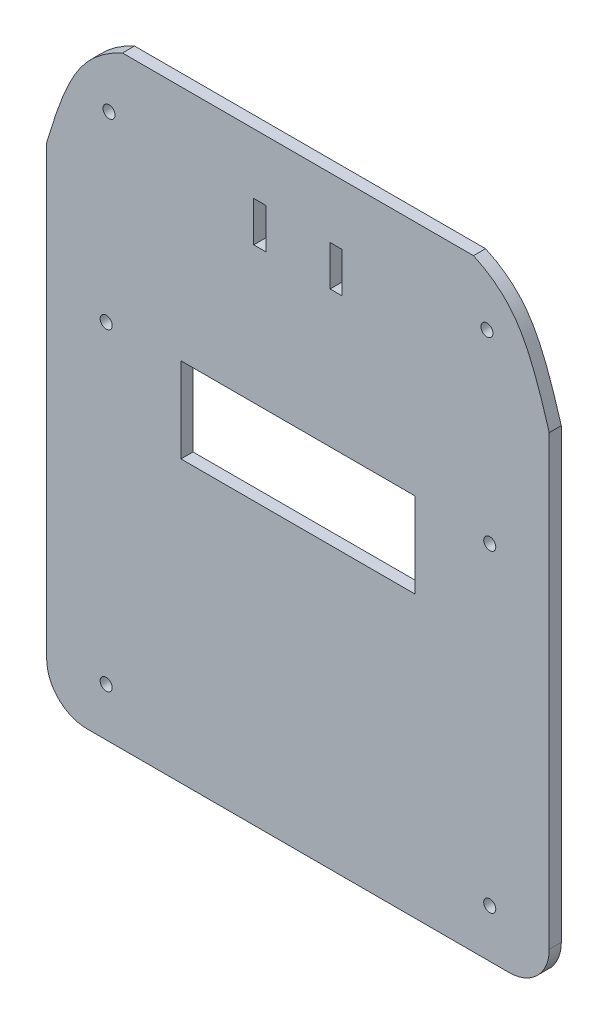
ISO-10303-21;
HEADER;
FILE_DESCRIPTION(('STEP AP214'),'2;1');
FILE_NAME('part.step','',(''),(''),'','','');
FILE_SCHEMA(('AUTOMOTIVE_DESIGN { 1 0 10303 214 1 1 1 1 }'));
ENDSEC;
DATA;
#1=APPLICATION_CONTEXT('core data for automotive mechanical design processes');
#2=APPLICATION_PROTOCOL_DEFINITION('international standard','automotive_design',2000,#1);
#3=PRODUCT_CONTEXT('',#1,'mechanical');
#4=PRODUCT('Part','Part','',(#3));
#5=PRODUCT_RELATED_PRODUCT_CATEGORY('part','',(#4));
#6=PRODUCT_DEFINITION_FORMATION('','',#4);
#7=PRODUCT_DEFINITION_CONTEXT('part definition',#1,'design');
#8=PRODUCT_DEFINITION('design','',#6,#7);
#9=PRODUCT_DEFINITION_SHAPE('','',#8);
#10=(LENGTH_UNIT() NAMED_UNIT(*) SI_UNIT(.MILLI.,.METRE.));
#11=(NAMED_UNIT(*) PLANE_ANGLE_UNIT() SI_UNIT($,.RADIAN.));
#12=(NAMED_UNIT(*) SI_UNIT($,.STERADIAN.) SOLID_ANGLE_UNIT());
#13=UNCERTAINTY_MEASURE_WITH_UNIT(LENGTH_MEASURE(1.E-05),#10,'distance_accuracy_value','');
#14=(GEOMETRIC_REPRESENTATION_CONTEXT(3) GLOBAL_UNCERTAINTY_ASSIGNED_CONTEXT((#13)) GLOBAL_UNIT_ASSIGNED_CONTEXT((#10,
#11,#12)) REPRESENTATION_CONTEXT('',''));
#15=CARTESIAN_POINT('',(0.,0.,0.));
#16=DIRECTION('',(0.,0.,1.));
#17=DIRECTION('',(1.,0.,0.));
#18=AXIS2_PLACEMENT_3D('',#15,#16,#17);
#19=CARTESIAN_POINT('',(0.,0.,3.));
#20=DIRECTION('',(1.,0.,0.));
#21=DIRECTION('',(0.,0.,-1.));
#22=AXIS2_PLACEMENT_3D('',#19,#20,#21);
#23=PLANE('',#22);
#24=DIRECTION('',(0.,-1.,0.));
#25=VECTOR('',#24,1.);
#26=CARTESIAN_POINT('',(0.,0.,0.));
#27=LINE('',#26,#25);
#28=CARTESIAN_POINT('',(0.,121.303805560754,0.));
#29=VERTEX_POINT('',#28);
#30=CARTESIAN_POINT('',(0.,10.,0.));
#31=VERTEX_POINT('',#30);
#32=EDGE_CURVE('E405',#29,#31,#27,.T.);
#33=ORIENTED_EDGE('',*,*,#32,.T.);
#34=DIRECTION('',(0.,0.,-1.));
#35=VECTOR('',#34,1.);
#36=CARTESIAN_POINT('',(0.,10.,3.));
#37=LINE('',#36,#35);
#38=CARTESIAN_POINT('',(0.,10.,3.));
#39=VERTEX_POINT('',#38);
#40=EDGE_CURVE('E11',#31,#39,#37,.F.);
#41=ORIENTED_EDGE('',*,*,#40,.T.);
#42=DIRECTION('',(0.,-1.,0.));
#43=VECTOR('',#42,1.);
#44=CARTESIAN_POINT('',(0.,0.,3.));
#45=LINE('',#44,#43);
#46=CARTESIAN_POINT('',(0.,121.303805560754,3.));
#47=VERTEX_POINT('',#46);
#48=EDGE_CURVE('E419',#47,#39,#45,.T.);
#49=ORIENTED_EDGE('',*,*,#48,.F.);
#50=DIRECTION('',(0.,0.,1.));
#51=VECTOR('',#50,1.);
#52=CARTESIAN_POINT('',(0.,121.303805560754,0.));
#53=LINE('',#52,#51);
#54=EDGE_CURVE('E418',#29,#47,#53,.T.);
#55=ORIENTED_EDGE('',*,*,#54,.F.);
#56=EDGE_LOOP('',(#33,#41,#49,#55));
#57=FACE_BOUND('',#56,.T.);
#58=ADVANCED_FACE('F38',(#57),#23,.F.);
#59=CARTESIAN_POINT('',(0.,0.,3.));
#60=DIRECTION('',(0.,1.,0.));
#61=DIRECTION('',(0.,0.,1.));
#62=AXIS2_PLACEMENT_3D('',#59,#60,#61);
#63=PLANE('',#62);
#64=DIRECTION('',(1.,0.,0.));
#65=VECTOR('',#64,1.);
#66=CARTESIAN_POINT('',(0.,0.,0.));
#67=LINE('',#66,#65);
#68=CARTESIAN_POINT('',(10.,0.,0.));
#69=VERTEX_POINT('',#68);
#70=CARTESIAN_POINT('',(115.,0.,0.));
#71=VERTEX_POINT('',#70);
#72=EDGE_CURVE('E439',#69,#71,#67,.T.);
#73=ORIENTED_EDGE('',*,*,#72,.T.);
#74=DIRECTION('',(0.,0.,-1.));
#75=VECTOR('',#74,1.);
#76=CARTESIAN_POINT('',(115.,0.,3.));
#77=LINE('',#76,#75);
#78=CARTESIAN_POINT('',(115.,0.,3.));
#79=VERTEX_POINT('',#78);
#80=EDGE_CURVE('E462',#71,#79,#77,.F.);
#81=ORIENTED_EDGE('',*,*,#80,.T.);
#82=DIRECTION('',(1.,0.,0.));
#83=VECTOR('',#82,1.);
#84=CARTESIAN_POINT('',(0.,0.,3.));
#85=LINE('',#84,#83);
#86=CARTESIAN_POINT('',(10.,0.,3.));
#87=VERTEX_POINT('',#86);
#88=EDGE_CURVE('E423',#87,#79,#85,.T.);
#89=ORIENTED_EDGE('',*,*,#88,.F.);
#90=DIRECTION('',(0.,0.,-1.));
#91=VECTOR('',#90,1.);
#92=CARTESIAN_POINT('',(10.,0.,3.));
#93=LINE('',#92,#91);
#94=EDGE_CURVE('E458',#87,#69,#93,.T.);
#95=ORIENTED_EDGE('',*,*,#94,.T.);
#96=EDGE_LOOP('',(#73,#81,#89,#95));
#97=FACE_BOUND('',#96,.T.);
#98=ADVANCED_FACE('F486',(#97),#63,.F.);
#99=CARTESIAN_POINT('',(125.,0.,3.));
#100=DIRECTION('',(-1.,0.,0.));
#101=DIRECTION('',(0.,0.,1.));
#102=AXIS2_PLACEMENT_3D('',#99,#100,#101);
#103=PLANE('',#102);
#104=DIRECTION('',(0.,1.,0.));
#105=VECTOR('',#104,1.);
#106=CARTESIAN_POINT('',(125.,0.,3.));
#107=LINE('',#106,#105);
#108=CARTESIAN_POINT('',(125.,10.,3.));
#109=VERTEX_POINT('',#108);
#110=CARTESIAN_POINT('',(125.,121.303805560754,3.));
#111=VERTEX_POINT('',#110);
#112=EDGE_CURVE('E428',#109,#111,#107,.T.);
#113=ORIENTED_EDGE('',*,*,#112,.F.);
#114=DIRECTION('',(0.,0.,-1.));
#115=VECTOR('',#114,1.);
#116=CARTESIAN_POINT('',(125.,10.,3.));
#117=LINE('',#116,#115);
#118=CARTESIAN_POINT('',(125.,10.,0.));
#119=VERTEX_POINT('',#118);
#120=EDGE_CURVE('E435',#109,#119,#117,.T.);
#121=ORIENTED_EDGE('',*,*,#120,.T.);
#122=DIRECTION('',(0.,1.,0.));
#123=VECTOR('',#122,1.);
#124=CARTESIAN_POINT('',(125.,0.,0.));
#125=LINE('',#124,#123);
#126=CARTESIAN_POINT('',(125.,121.303805560754,0.));
#127=VERTEX_POINT('',#126);
#128=EDGE_CURVE('E443',#119,#127,#125,.T.);
#129=ORIENTED_EDGE('',*,*,#128,.T.);
#130=DIRECTION('',(0.,0.,1.));
#131=VECTOR('',#130,1.);
#132=CARTESIAN_POINT('',(125.,121.303805560754,0.));
#133=LINE('',#132,#131);
#134=EDGE_CURVE('E383',#127,#111,#133,.T.);
#135=ORIENTED_EDGE('',*,*,#134,.T.);
#136=EDGE_LOOP('',(#113,#121,#129,#135));
#137=FACE_BOUND('',#136,.T.);
#138=ADVANCED_FACE('F478',(#137),#103,.F.);
#139=CARTESIAN_POINT('',(0.,150.,3.));
#140=DIRECTION('',(0.,-1.,0.));
#141=DIRECTION('',(0.,0.,-1.));
#142=AXIS2_PLACEMENT_3D('',#139,#140,#141);
#143=PLANE('',#142);
#144=DIRECTION('',(-1.,0.,0.));
#145=VECTOR('',#144,1.);
#146=CARTESIAN_POINT('',(0.,150.,0.));
#147=LINE('',#146,#145);
#148=CARTESIAN_POINT('',(106.161439589976,150.,0.));
#149=VERTEX_POINT('',#148);
#150=CARTESIAN_POINT('',(18.8385604100237,150.,0.));
#151=VERTEX_POINT('',#150);
#152=EDGE_CURVE('E424',#149,#151,#147,.T.);
#153=ORIENTED_EDGE('',*,*,#152,.T.);
#154=DIRECTION('',(0.,0.,1.));
#155=VECTOR('',#154,1.);
#156=CARTESIAN_POINT('',(18.8385604100237,150.,0.));
#157=LINE('',#156,#155);
#158=CARTESIAN_POINT('',(18.8385604100237,150.,3.));
#159=VERTEX_POINT('',#158);
#160=EDGE_CURVE('E352',#151,#159,#157,.T.);
#161=ORIENTED_EDGE('',*,*,#160,.T.);
#162=DIRECTION('',(-1.,0.,0.));
#163=VECTOR('',#162,1.);
#164=CARTESIAN_POINT('',(0.,150.,3.));
#165=LINE('',#164,#163);
#166=CARTESIAN_POINT('',(106.161439589976,150.,3.));
#167=VERTEX_POINT('',#166);
#168=EDGE_CURVE('E431',#167,#159,#165,.T.);
#169=ORIENTED_EDGE('',*,*,#168,.F.);
#170=DIRECTION('',(0.,0.,1.));
#171=VECTOR('',#170,1.);
#172=CARTESIAN_POINT('',(106.161439589976,150.,0.));
#173=LINE('',#172,#171);
#174=EDGE_CURVE('E392',#149,#167,#173,.T.);
#175=ORIENTED_EDGE('',*,*,#174,.F.);
#176=EDGE_LOOP('',(#153,#161,#169,#175));
#177=FACE_BOUND('',#176,.T.);
#178=ADVANCED_FACE('F501',(#177),#143,.F.);
#179=CARTESIAN_POINT('',(0.,0.,3.));
#180=DIRECTION('',(0.,0.,-1.));
#181=DIRECTION('',(-1.,0.,0.));
#182=AXIS2_PLACEMENT_3D('',#179,#180,#181);
#183=PLANE('',#182);
#184=DIRECTION('',(1.,0.,0.));
#185=VECTOR('',#184,1.);
#186=CARTESIAN_POINT('',(51.5,125.,3.));
#187=LINE('',#186,#185);
#188=CARTESIAN_POINT('',(51.5,125.,3.));
#189=VERTEX_POINT('',#188);
#190=CARTESIAN_POINT('',(54.5,125.,3.));
#191=VERTEX_POINT('',#190);
#192=EDGE_CURVE('E212',#189,#191,#187,.T.);
#193=ORIENTED_EDGE('',*,*,#192,.F.);
#194=DIRECTION('',(0.,-1.,0.));
#195=VECTOR('',#194,1.);
#196=CARTESIAN_POINT('',(51.5,125.,3.));
#197=LINE('',#196,#195);
#198=CARTESIAN_POINT('',(51.5,135.,3.));
#199=VERTEX_POINT('',#198);
#200=EDGE_CURVE('E54',#199,#189,#197,.T.);
#201=ORIENTED_EDGE('',*,*,#200,.F.);
#202=DIRECTION('',(-1.,0.,0.));
#203=VECTOR('',#202,1.);
#204=CARTESIAN_POINT('',(51.5,135.,3.));
#205=LINE('',#204,#203);
#206=CARTESIAN_POINT('',(54.5,135.,3.));
#207=VERTEX_POINT('',#206);
#208=EDGE_CURVE('E199',#207,#199,#205,.T.);
#209=ORIENTED_EDGE('',*,*,#208,.F.);
#210=DIRECTION('',(0.,1.,0.));
#211=VECTOR('',#210,1.);
#212=CARTESIAN_POINT('',(54.5,125.,3.));
#213=LINE('',#212,#211);
#214=EDGE_CURVE('E203',#191,#207,#213,.T.);
#215=ORIENTED_EDGE('',*,*,#214,.F.);
#216=EDGE_LOOP('',(#193,#201,#209,#215));
#217=FACE_BOUND('',#216,.T.);
#218=DIRECTION('',(0.,1.,0.));
#219=VECTOR('',#218,1.);
#220=CARTESIAN_POINT('',(73.5,125.,3.));
#221=LINE('',#220,#219);
#222=CARTESIAN_POINT('',(73.5,125.,3.));
#223=VERTEX_POINT('',#222);
#224=CARTESIAN_POINT('',(73.5,135.,3.));
#225=VERTEX_POINT('',#224);
#226=EDGE_CURVE('E248',#223,#225,#221,.T.);
#227=ORIENTED_EDGE('',*,*,#226,.F.);
#228=DIRECTION('',(1.,0.,0.));
#229=VECTOR('',#228,1.);
#230=CARTESIAN_POINT('',(73.5,125.,3.));
#231=LINE('',#230,#229);
#232=CARTESIAN_POINT('',(70.5,125.,3.));
#233=VERTEX_POINT('',#232);
#234=EDGE_CURVE('E62',#233,#223,#231,.T.);
#235=ORIENTED_EDGE('',*,*,#234,.F.);
#236=DIRECTION('',(0.,-1.,0.));
#237=VECTOR('',#236,1.);
#238=CARTESIAN_POINT('',(70.5,125.,3.));
#239=LINE('',#238,#237);
#240=CARTESIAN_POINT('',(70.5,135.,3.));
#241=VERTEX_POINT('',#240);
#242=EDGE_CURVE('E233',#241,#233,#239,.T.);
#243=ORIENTED_EDGE('',*,*,#242,.F.);
#244=DIRECTION('',(-1.,0.,0.));
#245=VECTOR('',#244,1.);
#246=CARTESIAN_POINT('',(73.5,135.,3.));
#247=LINE('',#246,#245);
#248=EDGE_CURVE('E252',#225,#241,#247,.T.);
#249=ORIENTED_EDGE('',*,*,#248,.F.);
#250=EDGE_LOOP('',(#227,#235,#243,#249));
#251=FACE_BOUND('',#250,.T.);
#252=DIRECTION('',(1.,0.,0.));
#253=VECTOR('',#252,1.);
#254=CARTESIAN_POINT('',(33.4014139140333,69.834441381547,3.));
#255=LINE('',#254,#253);
#256=CARTESIAN_POINT('',(33.4014139140333,69.834441381547,3.));
#257=VERTEX_POINT('',#256);
#258=CARTESIAN_POINT('',(91.5985860859667,69.834441381547,3.));
#259=VERTEX_POINT('',#258);
#260=EDGE_CURVE('E289',#257,#259,#255,.T.);
#261=ORIENTED_EDGE('',*,*,#260,.F.);
#262=DIRECTION('',(0.,-1.,0.));
#263=VECTOR('',#262,1.);
#264=CARTESIAN_POINT('',(33.4014139140333,90.9736993548838,3.));
#265=LINE('',#264,#263);
#266=CARTESIAN_POINT('',(33.4014139140333,90.9736993548838,3.));
#267=VERTEX_POINT('',#266);
#268=EDGE_CURVE('E222',#267,#257,#265,.T.);
#269=ORIENTED_EDGE('',*,*,#268,.F.);
#270=DIRECTION('',(-1.,0.,0.));
#271=VECTOR('',#270,1.);
#272=CARTESIAN_POINT('',(33.4014139140333,90.9736993548838,3.));
#273=LINE('',#272,#271);
#274=CARTESIAN_POINT('',(91.5985860859667,90.9736993548838,3.));
#275=VERTEX_POINT('',#274);
#276=EDGE_CURVE('E274',#275,#267,#273,.T.);
#277=ORIENTED_EDGE('',*,*,#276,.F.);
#278=DIRECTION('',(0.,1.,0.));
#279=VECTOR('',#278,1.);
#280=CARTESIAN_POINT('',(91.5985860859667,90.9736993548838,3.));
#281=LINE('',#280,#279);
#282=EDGE_CURVE('E293',#259,#275,#281,.T.);
#283=ORIENTED_EDGE('',*,*,#282,.F.);
#284=EDGE_LOOP('',(#261,#269,#277,#283));
#285=FACE_BOUND('',#284,.T.);
#286=CARTESIAN_POINT('',(14.8,90.,3.));
#287=DIRECTION('',(0.,0.,1.));
#288=DIRECTION('',(1.,0.,0.));
#289=AXIS2_PLACEMENT_3D('',#286,#287,#288);
#290=CIRCLE('',#289,1.5);
#291=CARTESIAN_POINT('',(16.3,90.,3.));
#292=VERTEX_POINT('',#291);
#293=EDGE_CURVE('E326',#292,#292,#290,.T.);
#294=ORIENTED_EDGE('',*,*,#293,.F.);
#295=EDGE_LOOP('',(#294));
#296=FACE_BOUND('',#295,.T.);
#297=CARTESIAN_POINT('',(110.2,12.,3.));
#298=DIRECTION('',(0.,0.,1.));
#299=DIRECTION('',(-1.,0.,0.));
#300=AXIS2_PLACEMENT_3D('',#297,#298,#299);
#301=CIRCLE('',#300,1.50000000000001);
#302=CARTESIAN_POINT('',(108.7,12.,3.));
#303=VERTEX_POINT('',#302);
#304=EDGE_CURVE('E317',#303,#303,#301,.T.);
#305=ORIENTED_EDGE('',*,*,#304,.F.);
#306=EDGE_LOOP('',(#305));
#307=FACE_BOUND('',#306,.T.);
#308=CARTESIAN_POINT('',(110.2,90.,3.));
#309=DIRECTION('',(0.,0.,1.));
#310=DIRECTION('',(-1.,0.,0.));
#311=AXIS2_PLACEMENT_3D('',#308,#309,#310);
#312=CIRCLE('',#311,1.5);
#313=CARTESIAN_POINT('',(108.7,90.,3.));
#314=VERTEX_POINT('',#313);
#315=EDGE_CURVE('E303',#314,#314,#312,.T.);
#316=ORIENTED_EDGE('',*,*,#315,.F.);
#317=EDGE_LOOP('',(#316));
#318=FACE_BOUND('',#317,.T.);
#319=CARTESIAN_POINT('',(14.8,12.,3.));
#320=DIRECTION('',(0.,0.,1.));
#321=DIRECTION('',(1.,0.,0.));
#322=AXIS2_PLACEMENT_3D('',#319,#320,#321);
#323=CIRCLE('',#322,1.5);
#324=CARTESIAN_POINT('',(16.3,12.,3.));
#325=VERTEX_POINT('',#324);
#326=EDGE_CURVE('E325',#325,#325,#323,.T.);
#327=ORIENTED_EDGE('',*,*,#326,.F.);
#328=EDGE_LOOP('',(#327));
#329=FACE_BOUND('',#328,.T.);
#330=CARTESIAN_POINT('',(15.5,135.678181118028,3.));
#331=DIRECTION('',(0.,0.,-1.));
#332=DIRECTION('',(-1.,0.,0.));
#333=AXIS2_PLACEMENT_3D('',#330,#331,#332);
#334=CIRCLE('',#333,1.5);
#335=CARTESIAN_POINT('',(14.,135.678181118028,3.));
#336=VERTEX_POINT('',#335);
#337=EDGE_CURVE('E401',#336,#336,#334,.T.);
#338=ORIENTED_EDGE('',*,*,#337,.T.);
#339=EDGE_LOOP('',(#338));
#340=FACE_BOUND('',#339,.T.);
#341=CARTESIAN_POINT('',(109.5,135.678181118028,3.));
#342=DIRECTION('',(0.,0.,-1.));
#343=DIRECTION('',(1.,0.,0.));
#344=AXIS2_PLACEMENT_3D('',#341,#342,#343);
#345=CIRCLE('',#344,1.5);
#346=CARTESIAN_POINT('',(111.,135.678181118028,3.));
#347=VERTEX_POINT('',#346);
#348=EDGE_CURVE('E410',#347,#347,#345,.T.);
#349=ORIENTED_EDGE('',*,*,#348,.T.);
#350=EDGE_LOOP('',(#349));
#351=FACE_BOUND('',#350,.T.);
#352=ORIENTED_EDGE('',*,*,#88,.T.);
#353=CARTESIAN_POINT('',(115.,10.,3.));
#354=DIRECTION('',(0.,0.,-1.));
#355=DIRECTION('',(-1.,0.,0.));
#356=AXIS2_PLACEMENT_3D('',#353,#354,#355);
#357=CIRCLE('',#356,10.);
#358=EDGE_CURVE('E47',#79,#109,#357,.F.);
#359=ORIENTED_EDGE('',*,*,#358,.T.);
#360=ORIENTED_EDGE('',*,*,#112,.T.);
#361=CARTESIAN_POINT('',(106.161439589976,150.,3.));
#362=CARTESIAN_POINT('',(111.706180100833,147.487302417575,3.));
#363=CARTESIAN_POINT('',(116.942879472197,143.174726464687,3.));
#364=CARTESIAN_POINT('',(119.869270297371,138.554109372307,3.));
#365=CARTESIAN_POINT('',(125.,121.303805560754,3.));
#366=B_SPLINE_CURVE_WITH_KNOTS('',4,(#361,#362,#363,#364,#365),.UNSPECIFIED.,.F.,.F.,(5,5),(0.,
1.),.UNSPECIFIED.);
#367=EDGE_CURVE('E341',#167,#111,#366,.T.);
#368=ORIENTED_EDGE('',*,*,#367,.F.);
#369=ORIENTED_EDGE('',*,*,#168,.T.);
#370=CARTESIAN_POINT('',(0.,121.303805560754,3.));
#371=CARTESIAN_POINT('',(5.13072970262918,138.554109372307,3.));
#372=CARTESIAN_POINT('',(8.05712052780327,143.174726464687,3.));
#373=CARTESIAN_POINT('',(13.2938198991675,147.487302417575,3.));
#374=CARTESIAN_POINT('',(18.8385604100237,150.,3.));
#375=B_SPLINE_CURVE_WITH_KNOTS('',4,(#370,#371,#372,#373,#374),.UNSPECIFIED.,.F.,.F.,(5,5),(0.,
1.),.UNSPECIFIED.);
#376=EDGE_CURVE('E353',#47,#159,#375,.T.);
#377=ORIENTED_EDGE('',*,*,#376,.F.);
#378=ORIENTED_EDGE('',*,*,#48,.T.);
#379=CARTESIAN_POINT('',(10.,10.,3.));
#380=DIRECTION('',(0.,0.,-1.));
#381=DIRECTION('',(-1.,0.,0.));
#382=AXIS2_PLACEMENT_3D('',#379,#380,#381);
#383=CIRCLE('',#382,10.);
#384=EDGE_CURVE('E465',#39,#87,#383,.F.);
#385=ORIENTED_EDGE('',*,*,#384,.T.);
#386=EDGE_LOOP('',(#352,#359,#360,#368,#369,#377,#378,#385));
#387=FACE_BOUND('',#386,.T.);
#388=ADVANCED_FACE('F471',(#217,#251,#285,#296,#307,#318,#329,#340,#351,#387),#183,.F.);
#389=CARTESIAN_POINT('',(0.,0.,0.));
#390=DIRECTION('',(0.,0.,-1.));
#391=DIRECTION('',(-1.,0.,0.));
#392=AXIS2_PLACEMENT_3D('',#389,#390,#391);
#393=PLANE('',#392);
#394=DIRECTION('',(0.,-1.,0.));
#395=VECTOR('',#394,1.);
#396=CARTESIAN_POINT('',(51.5,125.,0.));
#397=LINE('',#396,#395);
#398=CARTESIAN_POINT('',(51.5,135.,0.));
#399=VERTEX_POINT('',#398);
#400=CARTESIAN_POINT('',(51.5,125.,0.));
#401=VERTEX_POINT('',#400);
#402=EDGE_CURVE('E177',#399,#401,#397,.T.);
#403=ORIENTED_EDGE('',*,*,#402,.T.);
#404=DIRECTION('',(1.,0.,0.));
#405=VECTOR('',#404,1.);
#406=CARTESIAN_POINT('',(51.5,125.,0.));
#407=LINE('',#406,#405);
#408=CARTESIAN_POINT('',(54.5,125.,0.));
#409=VERTEX_POINT('',#408);
#410=EDGE_CURVE('E188',#401,#409,#407,.T.);
#411=ORIENTED_EDGE('',*,*,#410,.T.);
#412=DIRECTION('',(0.,1.,0.));
#413=VECTOR('',#412,1.);
#414=CARTESIAN_POINT('',(54.5,125.,0.));
#415=LINE('',#414,#413);
#416=CARTESIAN_POINT('',(54.5,135.,0.));
#417=VERTEX_POINT('',#416);
#418=EDGE_CURVE('E193',#409,#417,#415,.T.);
#419=ORIENTED_EDGE('',*,*,#418,.T.);
#420=DIRECTION('',(-1.,0.,0.));
#421=VECTOR('',#420,1.);
#422=CARTESIAN_POINT('',(51.5,135.,0.));
#423=LINE('',#422,#421);
#424=EDGE_CURVE('E184',#417,#399,#423,.T.);
#425=ORIENTED_EDGE('',*,*,#424,.T.);
#426=EDGE_LOOP('',(#403,#411,#419,#425));
#427=FACE_BOUND('',#426,.T.);
#428=DIRECTION('',(1.,0.,0.));
#429=VECTOR('',#428,1.);
#430=CARTESIAN_POINT('',(73.5,125.,0.));
#431=LINE('',#430,#429);
#432=CARTESIAN_POINT('',(70.5,125.,0.));
#433=VERTEX_POINT('',#432);
#434=CARTESIAN_POINT('',(73.5,125.,0.));
#435=VERTEX_POINT('',#434);
#436=EDGE_CURVE('E228',#433,#435,#431,.T.);
#437=ORIENTED_EDGE('',*,*,#436,.T.);
#438=DIRECTION('',(0.,1.,0.));
#439=VECTOR('',#438,1.);
#440=CARTESIAN_POINT('',(73.5,125.,0.));
#441=LINE('',#440,#439);
#442=CARTESIAN_POINT('',(73.5,135.,0.));
#443=VERTEX_POINT('',#442);
#444=EDGE_CURVE('E232',#435,#443,#441,.T.);
#445=ORIENTED_EDGE('',*,*,#444,.T.);
#446=DIRECTION('',(-1.,0.,0.));
#447=VECTOR('',#446,1.);
#448=CARTESIAN_POINT('',(73.5,135.,0.));
#449=LINE('',#448,#447);
#450=CARTESIAN_POINT('',(70.5,135.,0.));
#451=VERTEX_POINT('',#450);
#452=EDGE_CURVE('E237',#443,#451,#449,.T.);
#453=ORIENTED_EDGE('',*,*,#452,.T.);
#454=DIRECTION('',(0.,-1.,0.));
#455=VECTOR('',#454,1.);
#456=CARTESIAN_POINT('',(70.5,125.,0.));
#457=LINE('',#456,#455);
#458=EDGE_CURVE('E241',#451,#433,#457,.T.);
#459=ORIENTED_EDGE('',*,*,#458,.T.);
#460=EDGE_LOOP('',(#437,#445,#453,#459));
#461=FACE_BOUND('',#460,.T.);
#462=DIRECTION('',(0.,-1.,0.));
#463=VECTOR('',#462,1.);
#464=CARTESIAN_POINT('',(33.4014139140333,90.9736993548838,0.));
#465=LINE('',#464,#463);
#466=CARTESIAN_POINT('',(33.4014139140333,90.9736993548838,0.));
#467=VERTEX_POINT('',#466);
#468=CARTESIAN_POINT('',(33.4014139140333,69.834441381547,0.));
#469=VERTEX_POINT('',#468);
#470=EDGE_CURVE('E269',#467,#469,#465,.T.);
#471=ORIENTED_EDGE('',*,*,#470,.T.);
#472=DIRECTION('',(1.,0.,0.));
#473=VECTOR('',#472,1.);
#474=CARTESIAN_POINT('',(33.4014139140333,69.834441381547,0.));
#475=LINE('',#474,#473);
#476=CARTESIAN_POINT('',(91.5985860859667,69.834441381547,0.));
#477=VERTEX_POINT('',#476);
#478=EDGE_CURVE('E273',#469,#477,#475,.T.);
#479=ORIENTED_EDGE('',*,*,#478,.T.);
#480=DIRECTION('',(0.,1.,0.));
#481=VECTOR('',#480,1.);
#482=CARTESIAN_POINT('',(91.5985860859667,90.9736993548838,0.));
#483=LINE('',#482,#481);
#484=CARTESIAN_POINT('',(91.5985860859667,90.9736993548838,0.));
#485=VERTEX_POINT('',#484);
#486=EDGE_CURVE('E278',#477,#485,#483,.T.);
#487=ORIENTED_EDGE('',*,*,#486,.T.);
#488=DIRECTION('',(-1.,0.,0.));
#489=VECTOR('',#488,1.);
#490=CARTESIAN_POINT('',(33.4014139140333,90.9736993548838,0.));
#491=LINE('',#490,#489);
#492=EDGE_CURVE('E282',#485,#467,#491,.T.);
#493=ORIENTED_EDGE('',*,*,#492,.T.);
#494=EDGE_LOOP('',(#471,#479,#487,#493));
#495=FACE_BOUND('',#494,.T.);
#496=CARTESIAN_POINT('',(14.8,90.,0.));
#497=DIRECTION('',(0.,0.,1.));
#498=DIRECTION('',(1.,0.,0.));
#499=AXIS2_PLACEMENT_3D('',#496,#497,#498);
#500=CIRCLE('',#499,1.5);
#501=CARTESIAN_POINT('',(16.3,90.,0.));
#502=VERTEX_POINT('',#501);
#503=EDGE_CURVE('E321',#502,#502,#500,.T.);
#504=ORIENTED_EDGE('',*,*,#503,.T.);
#505=EDGE_LOOP('',(#504));
#506=FACE_BOUND('',#505,.T.);
#507=CARTESIAN_POINT('',(110.2,12.,0.));
#508=DIRECTION('',(0.,0.,1.));
#509=DIRECTION('',(-1.,0.,0.));
#510=AXIS2_PLACEMENT_3D('',#507,#508,#509);
#511=CIRCLE('',#510,1.50000000000001);
#512=CARTESIAN_POINT('',(108.7,12.,0.));
#513=VERTEX_POINT('',#512);
#514=EDGE_CURVE('E330',#513,#513,#511,.T.);
#515=ORIENTED_EDGE('',*,*,#514,.T.);
#516=EDGE_LOOP('',(#515));
#517=FACE_BOUND('',#516,.T.);
#518=CARTESIAN_POINT('',(110.2,90.,0.));
#519=DIRECTION('',(0.,0.,1.));
#520=DIRECTION('',(-1.,0.,0.));
#521=AXIS2_PLACEMENT_3D('',#518,#519,#520);
#522=CIRCLE('',#521,1.5);
#523=CARTESIAN_POINT('',(108.7,90.,0.));
#524=VERTEX_POINT('',#523);
#525=EDGE_CURVE('E313',#524,#524,#522,.T.);
#526=ORIENTED_EDGE('',*,*,#525,.T.);
#527=EDGE_LOOP('',(#526));
#528=FACE_BOUND('',#527,.T.);
#529=CARTESIAN_POINT('',(14.8,12.,0.));
#530=DIRECTION('',(0.,0.,1.));
#531=DIRECTION('',(1.,0.,0.));
#532=AXIS2_PLACEMENT_3D('',#529,#530,#531);
#533=CIRCLE('',#532,1.5);
#534=CARTESIAN_POINT('',(16.3,12.,0.));
#535=VERTEX_POINT('',#534);
#536=EDGE_CURVE('E337',#535,#535,#533,.T.);
#537=ORIENTED_EDGE('',*,*,#536,.T.);
#538=EDGE_LOOP('',(#537));
#539=FACE_BOUND('',#538,.T.);
#540=ORIENTED_EDGE('',*,*,#128,.F.);
#541=CARTESIAN_POINT('',(115.,10.,0.));
#542=DIRECTION('',(0.,0.,-1.));
#543=DIRECTION('',(-1.,0.,0.));
#544=AXIS2_PLACEMENT_3D('',#541,#542,#543);
#545=CIRCLE('',#544,10.);
#546=EDGE_CURVE('E455',#119,#71,#545,.T.);
#547=ORIENTED_EDGE('',*,*,#546,.T.);
#548=ORIENTED_EDGE('',*,*,#72,.F.);
#549=CARTESIAN_POINT('',(10.,10.,0.));
#550=DIRECTION('',(0.,0.,-1.));
#551=DIRECTION('',(-1.,0.,0.));
#552=AXIS2_PLACEMENT_3D('',#549,#550,#551);
#553=CIRCLE('',#552,10.);
#554=EDGE_CURVE('E452',#69,#31,#553,.T.);
#555=ORIENTED_EDGE('',*,*,#554,.T.);
#556=ORIENTED_EDGE('',*,*,#32,.F.);
#557=CARTESIAN_POINT('',(0.,121.303805560754,0.));
#558=CARTESIAN_POINT('',(5.13072970262918,138.554109372307,0.));
#559=CARTESIAN_POINT('',(8.05712052780327,143.174726464687,0.));
#560=CARTESIAN_POINT('',(13.2938198991675,147.487302417575,0.));
#561=CARTESIAN_POINT('',(18.8385604100237,150.,0.));
#562=B_SPLINE_CURVE_WITH_KNOTS('',4,(#557,#558,#559,#560,#561),.UNSPECIFIED.,.F.,.F.,(5,5),(0.,
1.),.UNSPECIFIED.);
#563=EDGE_CURVE('E345',#29,#151,#562,.T.);
#564=ORIENTED_EDGE('',*,*,#563,.T.);
#565=ORIENTED_EDGE('',*,*,#152,.F.);
#566=CARTESIAN_POINT('',(106.161439589976,150.,0.));
#567=CARTESIAN_POINT('',(111.706180100833,147.487302417575,0.));
#568=CARTESIAN_POINT('',(116.942879472197,143.174726464687,0.));
#569=CARTESIAN_POINT('',(119.869270297371,138.554109372307,0.));
#570=CARTESIAN_POINT('',(125.,121.303805560754,0.));
#571=B_SPLINE_CURVE_WITH_KNOTS('',4,(#566,#567,#568,#569,#570),.UNSPECIFIED.,.F.,.F.,(5,5),(0.,
1.),.UNSPECIFIED.);
#572=EDGE_CURVE('E375',#149,#127,#571,.T.);
#573=ORIENTED_EDGE('',*,*,#572,.T.);
#574=EDGE_LOOP('',(#540,#547,#548,#555,#556,#564,#565,#573));
#575=FACE_BOUND('',#574,.T.);
#576=CARTESIAN_POINT('',(15.5,135.678181118028,0.));
#577=DIRECTION('',(0.,0.,-1.));
#578=DIRECTION('',(-1.,0.,0.));
#579=AXIS2_PLACEMENT_3D('',#576,#577,#578);
#580=CIRCLE('',#579,1.5);
#581=CARTESIAN_POINT('',(14.,135.678181118028,0.));
#582=VERTEX_POINT('',#581);
#583=EDGE_CURVE('E406',#582,#582,#580,.T.);
#584=ORIENTED_EDGE('',*,*,#583,.F.);
#585=EDGE_LOOP('',(#584));
#586=FACE_BOUND('',#585,.T.);
#587=CARTESIAN_POINT('',(109.5,135.678181118028,0.));
#588=DIRECTION('',(0.,0.,-1.));
#589=DIRECTION('',(1.,0.,0.));
#590=AXIS2_PLACEMENT_3D('',#587,#588,#589);
#591=CIRCLE('',#590,1.5);
#592=CARTESIAN_POINT('',(111.,135.678181118028,0.));
#593=VERTEX_POINT('',#592);
#594=EDGE_CURVE('E414',#593,#593,#591,.T.);
#595=ORIENTED_EDGE('',*,*,#594,.F.);
#596=EDGE_LOOP('',(#595));
#597=FACE_BOUND('',#596,.T.);
#598=ADVANCED_FACE('F195',(#427,#461,#495,#506,#517,#528,#539,#575,#586,#597),#393,.T.);
#599=CARTESIAN_POINT('',(109.5,135.678181118028,3.));
#600=DIRECTION('',(0.,0.,-1.));
#601=DIRECTION('',(-1.,0.,0.));
#602=AXIS2_PLACEMENT_3D('',#599,#600,#601);
#603=CYLINDRICAL_SURFACE('',#602,1.5);
#604=ORIENTED_EDGE('',*,*,#348,.F.);
#605=EDGE_LOOP('',(#604));
#606=FACE_BOUND('',#605,.T.);
#607=ORIENTED_EDGE('',*,*,#594,.T.);
#608=EDGE_LOOP('',(#607));
#609=FACE_BOUND('',#608,.T.);
#610=ADVANCED_FACE('F608',(#606,#609),#603,.F.);
#611=CARTESIAN_POINT('',(15.5,135.678181118028,3.));
#612=DIRECTION('',(0.,0.,-1.));
#613=DIRECTION('',(-1.,0.,0.));
#614=AXIS2_PLACEMENT_3D('',#611,#612,#613);
#615=CYLINDRICAL_SURFACE('',#614,1.5);
#616=ORIENTED_EDGE('',*,*,#337,.F.);
#617=EDGE_LOOP('',(#616));
#618=FACE_BOUND('',#617,.T.);
#619=ORIENTED_EDGE('',*,*,#583,.T.);
#620=EDGE_LOOP('',(#619));
#621=FACE_BOUND('',#620,.T.);
#622=ADVANCED_FACE('F372',(#618,#621),#615,.F.);
#623=DIRECTION('',(0.,0.,1.));
#624=VECTOR('',#623,1.);
#625=SURFACE_OF_LINEAR_EXTRUSION('',#571,#624);
#626=ORIENTED_EDGE('',*,*,#367,.T.);
#627=ORIENTED_EDGE('',*,*,#134,.F.);
#628=ORIENTED_EDGE('',*,*,#572,.F.);
#629=ORIENTED_EDGE('',*,*,#174,.T.);
#630=EDGE_LOOP('',(#626,#627,#628,#629));
#631=FACE_BOUND('',#630,.T.);
#632=ADVANCED_FACE('F366',(#631),#625,.F.);
#633=DIRECTION('',(0.,0.,1.));
#634=VECTOR('',#633,1.);
#635=SURFACE_OF_LINEAR_EXTRUSION('',#562,#634);
#636=ORIENTED_EDGE('',*,*,#376,.T.);
#637=ORIENTED_EDGE('',*,*,#160,.F.);
#638=ORIENTED_EDGE('',*,*,#563,.F.);
#639=ORIENTED_EDGE('',*,*,#54,.T.);
#640=EDGE_LOOP('',(#636,#637,#638,#639));
#641=FACE_BOUND('',#640,.T.);
#642=ADVANCED_FACE('F361',(#641),#635,.F.);
#643=CARTESIAN_POINT('',(14.8,12.,0.));
#644=DIRECTION('',(0.,0.,1.));
#645=DIRECTION('',(1.,0.,0.));
#646=AXIS2_PLACEMENT_3D('',#643,#644,#645);
#647=CYLINDRICAL_SURFACE('',#646,1.5);
#648=ORIENTED_EDGE('',*,*,#536,.F.);
#649=EDGE_LOOP('',(#648));
#650=FACE_BOUND('',#649,.T.);
#651=ORIENTED_EDGE('',*,*,#326,.T.);
#652=EDGE_LOOP('',(#651));
#653=FACE_BOUND('',#652,.T.);
#654=ADVANCED_FACE('F365',(#650,#653),#647,.F.);
#655=CARTESIAN_POINT('',(110.2,90.,0.));
#656=DIRECTION('',(0.,0.,1.));
#657=DIRECTION('',(1.,0.,0.));
#658=AXIS2_PLACEMENT_3D('',#655,#656,#657);
#659=CYLINDRICAL_SURFACE('',#658,1.5);
#660=ORIENTED_EDGE('',*,*,#525,.F.);
#661=EDGE_LOOP('',(#660));
#662=FACE_BOUND('',#661,.T.);
#663=ORIENTED_EDGE('',*,*,#315,.T.);
#664=EDGE_LOOP('',(#663));
#665=FACE_BOUND('',#664,.T.);
#666=ADVANCED_FACE('F535',(#662,#665),#659,.F.);
#667=CARTESIAN_POINT('',(110.2,12.,0.));
#668=DIRECTION('',(0.,0.,1.));
#669=DIRECTION('',(1.,0.,0.));
#670=AXIS2_PLACEMENT_3D('',#667,#668,#669);
#671=CYLINDRICAL_SURFACE('',#670,1.50000000000001);
#672=ORIENTED_EDGE('',*,*,#514,.F.);
#673=EDGE_LOOP('',(#672));
#674=FACE_BOUND('',#673,.T.);
#675=ORIENTED_EDGE('',*,*,#304,.T.);
#676=EDGE_LOOP('',(#675));
#677=FACE_BOUND('',#676,.T.);
#678=ADVANCED_FACE('F529',(#674,#677),#671,.F.);
#679=CARTESIAN_POINT('',(14.8,90.,0.));
#680=DIRECTION('',(0.,0.,1.));
#681=DIRECTION('',(1.,0.,0.));
#682=AXIS2_PLACEMENT_3D('',#679,#680,#681);
#683=CYLINDRICAL_SURFACE('',#682,1.5);
#684=ORIENTED_EDGE('',*,*,#503,.F.);
#685=EDGE_LOOP('',(#684));
#686=FACE_BOUND('',#685,.T.);
#687=ORIENTED_EDGE('',*,*,#293,.T.);
#688=EDGE_LOOP('',(#687));
#689=FACE_BOUND('',#688,.T.);
#690=ADVANCED_FACE('F523',(#686,#689),#683,.F.);
#691=CARTESIAN_POINT('',(115.,10.,3.));
#692=DIRECTION('',(0.,0.,-1.));
#693=DIRECTION('',(-1.,0.,0.));
#694=AXIS2_PLACEMENT_3D('',#691,#692,#693);
#695=CYLINDRICAL_SURFACE('',#694,10.);
#696=ORIENTED_EDGE('',*,*,#358,.F.);
#697=ORIENTED_EDGE('',*,*,#80,.F.);
#698=ORIENTED_EDGE('',*,*,#546,.F.);
#699=ORIENTED_EDGE('',*,*,#120,.F.);
#700=EDGE_LOOP('',(#696,#697,#698,#699));
#701=FACE_BOUND('',#700,.T.);
#702=ADVANCED_FACE('F481',(#701),#695,.T.);
#703=CARTESIAN_POINT('',(10.,10.,3.));
#704=DIRECTION('',(0.,0.,-1.));
#705=DIRECTION('',(-1.,0.,0.));
#706=AXIS2_PLACEMENT_3D('',#703,#704,#705);
#707=CYLINDRICAL_SURFACE('',#706,10.);
#708=ORIENTED_EDGE('',*,*,#384,.F.);
#709=ORIENTED_EDGE('',*,*,#40,.F.);
#710=ORIENTED_EDGE('',*,*,#554,.F.);
#711=ORIENTED_EDGE('',*,*,#94,.F.);
#712=EDGE_LOOP('',(#708,#709,#710,#711));
#713=FACE_BOUND('',#712,.T.);
#714=ADVANCED_FACE('F40',(#713),#707,.T.);
#715=CARTESIAN_POINT('',(33.4014139140333,90.9736993548838,0.));
#716=DIRECTION('',(-1.,0.,0.));
#717=DIRECTION('',(0.,0.,1.));
#718=AXIS2_PLACEMENT_3D('',#715,#716,#717);
#719=PLANE('',#718);
#720=ORIENTED_EDGE('',*,*,#268,.T.);
#721=DIRECTION('',(0.,0.,1.));
#722=VECTOR('',#721,1.);
#723=CARTESIAN_POINT('',(33.4014139140333,69.834441381547,0.));
#724=LINE('',#723,#722);
#725=EDGE_CURVE('E286',#469,#257,#724,.T.);
#726=ORIENTED_EDGE('',*,*,#725,.F.);
#727=ORIENTED_EDGE('',*,*,#470,.F.);
#728=DIRECTION('',(0.,0.,1.));
#729=VECTOR('',#728,1.);
#730=CARTESIAN_POINT('',(33.4014139140333,90.9736993548838,0.));
#731=LINE('',#730,#729);
#732=EDGE_CURVE('E300',#467,#267,#731,.T.);
#733=ORIENTED_EDGE('',*,*,#732,.T.);
#734=EDGE_LOOP('',(#720,#726,#727,#733));
#735=FACE_BOUND('',#734,.T.);
#736=ADVANCED_FACE('F528',(#735),#719,.F.);
#737=CARTESIAN_POINT('',(33.4014139140333,90.9736993548838,0.));
#738=DIRECTION('',(0.,1.,0.));
#739=DIRECTION('',(0.,0.,1.));
#740=AXIS2_PLACEMENT_3D('',#737,#738,#739);
#741=PLANE('',#740);
#742=ORIENTED_EDGE('',*,*,#276,.T.);
#743=ORIENTED_EDGE('',*,*,#732,.F.);
#744=ORIENTED_EDGE('',*,*,#492,.F.);
#745=DIRECTION('',(0.,0.,1.));
#746=VECTOR('',#745,1.);
#747=CARTESIAN_POINT('',(91.5985860859667,90.9736993548838,0.));
#748=LINE('',#747,#746);
#749=EDGE_CURVE('E304',#485,#275,#748,.T.);
#750=ORIENTED_EDGE('',*,*,#749,.T.);
#751=EDGE_LOOP('',(#742,#743,#744,#750));
#752=FACE_BOUND('',#751,.T.);
#753=ADVANCED_FACE('F545',(#752),#741,.F.);
#754=CARTESIAN_POINT('',(91.5985860859667,90.9736993548838,0.));
#755=DIRECTION('',(1.,0.,0.));
#756=DIRECTION('',(0.,0.,-1.));
#757=AXIS2_PLACEMENT_3D('',#754,#755,#756);
#758=PLANE('',#757);
#759=ORIENTED_EDGE('',*,*,#282,.T.);
#760=ORIENTED_EDGE('',*,*,#749,.F.);
#761=ORIENTED_EDGE('',*,*,#486,.F.);
#762=DIRECTION('',(0.,0.,1.));
#763=VECTOR('',#762,1.);
#764=CARTESIAN_POINT('',(91.5985860859667,69.834441381547,0.));
#765=LINE('',#764,#763);
#766=EDGE_CURVE('E307',#477,#259,#765,.T.);
#767=ORIENTED_EDGE('',*,*,#766,.T.);
#768=EDGE_LOOP('',(#759,#760,#761,#767));
#769=FACE_BOUND('',#768,.T.);
#770=ADVANCED_FACE('F551',(#769),#758,.F.);
#771=CARTESIAN_POINT('',(33.4014139140333,69.834441381547,0.));
#772=DIRECTION('',(0.,-1.,0.));
#773=DIRECTION('',(0.,0.,-1.));
#774=AXIS2_PLACEMENT_3D('',#771,#772,#773);
#775=PLANE('',#774);
#776=ORIENTED_EDGE('',*,*,#260,.T.);
#777=ORIENTED_EDGE('',*,*,#766,.F.);
#778=ORIENTED_EDGE('',*,*,#478,.F.);
#779=ORIENTED_EDGE('',*,*,#725,.T.);
#780=EDGE_LOOP('',(#776,#777,#778,#779));
#781=FACE_BOUND('',#780,.T.);
#782=ADVANCED_FACE('F547',(#781),#775,.F.);
#783=CARTESIAN_POINT('',(73.5,125.,0.));
#784=DIRECTION('',(0.,-1.,0.));
#785=DIRECTION('',(0.,0.,-1.));
#786=AXIS2_PLACEMENT_3D('',#783,#784,#785);
#787=PLANE('',#786);
#788=ORIENTED_EDGE('',*,*,#234,.T.);
#789=DIRECTION('',(0.,0.,1.));
#790=VECTOR('',#789,1.);
#791=CARTESIAN_POINT('',(73.5,125.,0.));
#792=LINE('',#791,#790);
#793=EDGE_CURVE('E245',#435,#223,#792,.T.);
#794=ORIENTED_EDGE('',*,*,#793,.F.);
#795=ORIENTED_EDGE('',*,*,#436,.F.);
#796=DIRECTION('',(0.,0.,1.));
#797=VECTOR('',#796,1.);
#798=CARTESIAN_POINT('',(70.5,125.,0.));
#799=LINE('',#798,#797);
#800=EDGE_CURVE('E213',#433,#233,#799,.T.);
#801=ORIENTED_EDGE('',*,*,#800,.T.);
#802=EDGE_LOOP('',(#788,#794,#795,#801));
#803=FACE_BOUND('',#802,.T.);
#804=ADVANCED_FACE('F550',(#803),#787,.F.);
#805=CARTESIAN_POINT('',(70.5,125.,0.));
#806=DIRECTION('',(-1.,0.,0.));
#807=DIRECTION('',(0.,0.,1.));
#808=AXIS2_PLACEMENT_3D('',#805,#806,#807);
#809=PLANE('',#808);
#810=ORIENTED_EDGE('',*,*,#242,.T.);
#811=ORIENTED_EDGE('',*,*,#800,.F.);
#812=ORIENTED_EDGE('',*,*,#458,.F.);
#813=DIRECTION('',(0.,0.,1.));
#814=VECTOR('',#813,1.);
#815=CARTESIAN_POINT('',(70.5,135.,0.));
#816=LINE('',#815,#814);
#817=EDGE_CURVE('E261',#451,#241,#816,.T.);
#818=ORIENTED_EDGE('',*,*,#817,.T.);
#819=EDGE_LOOP('',(#810,#811,#812,#818));
#820=FACE_BOUND('',#819,.T.);
#821=ADVANCED_FACE('F561',(#820),#809,.F.);
#822=CARTESIAN_POINT('',(73.5,135.,0.));
#823=DIRECTION('',(0.,1.,0.));
#824=DIRECTION('',(0.,0.,1.));
#825=AXIS2_PLACEMENT_3D('',#822,#823,#824);
#826=PLANE('',#825);
#827=ORIENTED_EDGE('',*,*,#248,.T.);
#828=ORIENTED_EDGE('',*,*,#817,.F.);
#829=ORIENTED_EDGE('',*,*,#452,.F.);
#830=DIRECTION('',(0.,0.,1.));
#831=VECTOR('',#830,1.);
#832=CARTESIAN_POINT('',(73.5,135.,0.));
#833=LINE('',#832,#831);
#834=EDGE_CURVE('E264',#443,#225,#833,.T.);
#835=ORIENTED_EDGE('',*,*,#834,.T.);
#836=EDGE_LOOP('',(#827,#828,#829,#835));
#837=FACE_BOUND('',#836,.T.);
#838=ADVANCED_FACE('F565',(#837),#826,.F.);
#839=CARTESIAN_POINT('',(73.5,125.,0.));
#840=DIRECTION('',(1.,0.,0.));
#841=DIRECTION('',(0.,0.,-1.));
#842=AXIS2_PLACEMENT_3D('',#839,#840,#841);
#843=PLANE('',#842);
#844=ORIENTED_EDGE('',*,*,#226,.T.);
#845=ORIENTED_EDGE('',*,*,#834,.F.);
#846=ORIENTED_EDGE('',*,*,#444,.F.);
#847=ORIENTED_EDGE('',*,*,#793,.T.);
#848=EDGE_LOOP('',(#844,#845,#846,#847));
#849=FACE_BOUND('',#848,.T.);
#850=ADVANCED_FACE('F562',(#849),#843,.F.);
#851=CARTESIAN_POINT('',(51.5,125.,0.));
#852=DIRECTION('',(-1.,0.,0.));
#853=DIRECTION('',(0.,0.,1.));
#854=AXIS2_PLACEMENT_3D('',#851,#852,#853);
#855=PLANE('',#854);
#856=ORIENTED_EDGE('',*,*,#200,.T.);
#857=DIRECTION('',(0.,0.,1.));
#858=VECTOR('',#857,1.);
#859=CARTESIAN_POINT('',(51.5,125.,0.));
#860=LINE('',#859,#858);
#861=EDGE_CURVE('E173',#401,#189,#860,.T.);
#862=ORIENTED_EDGE('',*,*,#861,.F.);
#863=ORIENTED_EDGE('',*,*,#402,.F.);
#864=DIRECTION('',(0.,0.,1.));
#865=VECTOR('',#864,1.);
#866=CARTESIAN_POINT('',(51.5,135.,0.));
#867=LINE('',#866,#865);
#868=EDGE_CURVE('E219',#399,#199,#867,.T.);
#869=ORIENTED_EDGE('',*,*,#868,.T.);
#870=EDGE_LOOP('',(#856,#862,#863,#869));
#871=FACE_BOUND('',#870,.T.);
#872=ADVANCED_FACE('F175',(#871),#855,.F.);
#873=CARTESIAN_POINT('',(51.5,135.,0.));
#874=DIRECTION('',(0.,1.,0.));
#875=DIRECTION('',(0.,0.,1.));
#876=AXIS2_PLACEMENT_3D('',#873,#874,#875);
#877=PLANE('',#876);
#878=ORIENTED_EDGE('',*,*,#208,.T.);
#879=ORIENTED_EDGE('',*,*,#868,.F.);
#880=ORIENTED_EDGE('',*,*,#424,.F.);
#881=DIRECTION('',(0.,0.,1.));
#882=VECTOR('',#881,1.);
#883=CARTESIAN_POINT('',(54.5,135.,0.));
#884=LINE('',#883,#882);
#885=EDGE_CURVE('E223',#417,#207,#884,.T.);
#886=ORIENTED_EDGE('',*,*,#885,.T.);
#887=EDGE_LOOP('',(#878,#879,#880,#886));
#888=FACE_BOUND('',#887,.T.);
#889=ADVANCED_FACE('F575',(#888),#877,.F.);
#890=CARTESIAN_POINT('',(54.5,125.,0.));
#891=DIRECTION('',(1.,0.,0.));
#892=DIRECTION('',(0.,0.,-1.));
#893=AXIS2_PLACEMENT_3D('',#890,#891,#892);
#894=PLANE('',#893);
#895=ORIENTED_EDGE('',*,*,#214,.T.);
#896=ORIENTED_EDGE('',*,*,#885,.F.);
#897=ORIENTED_EDGE('',*,*,#418,.F.);
#898=DIRECTION('',(0.,0.,1.));
#899=VECTOR('',#898,1.);
#900=CARTESIAN_POINT('',(54.5,125.,0.));
#901=LINE('',#900,#899);
#902=EDGE_CURVE('E183',#409,#191,#901,.T.);
#903=ORIENTED_EDGE('',*,*,#902,.T.);
#904=EDGE_LOOP('',(#895,#896,#897,#903));
#905=FACE_BOUND('',#904,.T.);
#906=ADVANCED_FACE('F578',(#905),#894,.F.);
#907=CARTESIAN_POINT('',(51.5,125.,0.));
#908=DIRECTION('',(0.,-1.,0.));
#909=DIRECTION('',(0.,0.,-1.));
#910=AXIS2_PLACEMENT_3D('',#907,#908,#909);
#911=PLANE('',#910);
#912=ORIENTED_EDGE('',*,*,#192,.T.);
#913=ORIENTED_EDGE('',*,*,#902,.F.);
#914=ORIENTED_EDGE('',*,*,#410,.F.);
#915=ORIENTED_EDGE('',*,*,#861,.T.);
#916=EDGE_LOOP('',(#912,#913,#914,#915));
#917=FACE_BOUND('',#916,.T.);
#918=ADVANCED_FACE('F189',(#917),#911,.F.);
#919=CLOSED_SHELL('',(#58,#98,#138,#178,#388,#598,#610,#622,#632,#642,#654,#666,#678,#690,#702,
#714,#736,#753,#770,#782,#804,#821,#838,#850,#872,#889,#906,#918));
#920=MANIFOLD_SOLID_BREP('B2',#919);
#921=ADVANCED_BREP_SHAPE_REPRESENTATION('',(#18,#920),#14);
#922=SHAPE_DEFINITION_REPRESENTATION(#9,#921);
ENDSEC;
END-ISO-10303-21;
